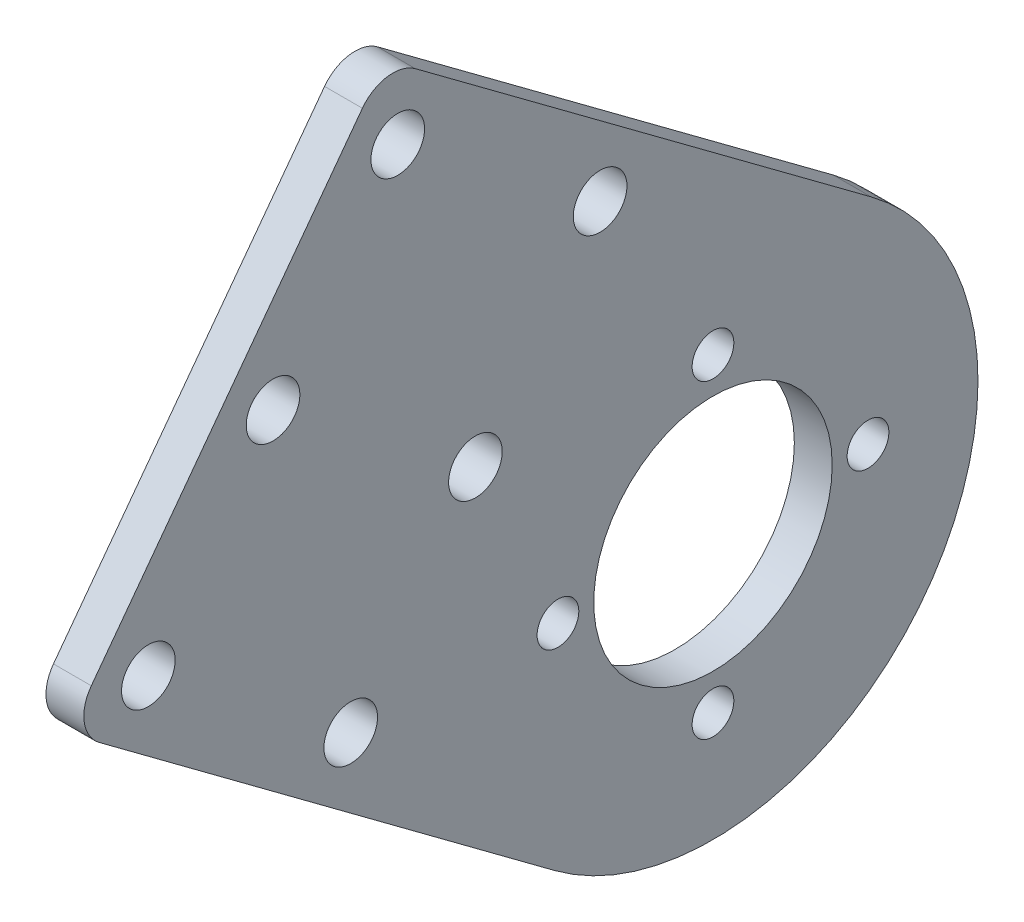
ISO-10303-21;
HEADER;
FILE_DESCRIPTION(('STEP AP214'),'2;1');
FILE_NAME('part.step','',(''),(''),'','','');
FILE_SCHEMA(('AUTOMOTIVE_DESIGN { 1 0 10303 214 1 1 1 1 }'));
ENDSEC;
DATA;
#1=APPLICATION_CONTEXT('core data for automotive mechanical design processes');
#2=APPLICATION_PROTOCOL_DEFINITION('international standard','automotive_design',2000,#1);
#3=PRODUCT_CONTEXT('',#1,'mechanical');
#4=PRODUCT('Part','Part','',(#3));
#5=PRODUCT_RELATED_PRODUCT_CATEGORY('part','',(#4));
#6=PRODUCT_DEFINITION_FORMATION('','',#4);
#7=PRODUCT_DEFINITION_CONTEXT('part definition',#1,'design');
#8=PRODUCT_DEFINITION('design','',#6,#7);
#9=PRODUCT_DEFINITION_SHAPE('','',#8);
#10=(LENGTH_UNIT() NAMED_UNIT(*) SI_UNIT(.MILLI.,.METRE.));
#11=(NAMED_UNIT(*) PLANE_ANGLE_UNIT() SI_UNIT($,.RADIAN.));
#12=(NAMED_UNIT(*) SI_UNIT($,.STERADIAN.) SOLID_ANGLE_UNIT());
#13=UNCERTAINTY_MEASURE_WITH_UNIT(LENGTH_MEASURE(1.E-05),#10,'distance_accuracy_value','');
#14=(GEOMETRIC_REPRESENTATION_CONTEXT(3) GLOBAL_UNCERTAINTY_ASSIGNED_CONTEXT((#13)) GLOBAL_UNIT_ASSIGNED_CONTEXT((#10,
#11,#12)) REPRESENTATION_CONTEXT('',''));
#15=CARTESIAN_POINT('',(0.,0.,0.));
#16=DIRECTION('',(0.,0.,1.));
#17=DIRECTION('',(1.,0.,0.));
#18=AXIS2_PLACEMENT_3D('',#15,#16,#17);
#19=CARTESIAN_POINT('',(3.175,87.5000000000012,-398.98926197498));
#20=DIRECTION('',(1.,0.,0.));
#21=DIRECTION('',(0.,0.,-1.));
#22=AXIS2_PLACEMENT_3D('',#19,#20,#21);
#23=PLANE('',#22);
#24=CARTESIAN_POINT('',(3.175,114.932192950069,-362.096397272571));
#25=DIRECTION('',(1.,0.,0.));
#26=DIRECTION('',(0.,0.,-1.));
#27=AXIS2_PLACEMENT_3D('',#24,#25,#26);
#28=CIRCLE('',#27,2.24999999999995);
#29=CARTESIAN_POINT('',(3.175,114.932192950069,-364.346397272571));
#30=VERTEX_POINT('',#29);
#31=EDGE_CURVE('E223',#30,#30,#28,.T.);
#32=ORIENTED_EDGE('',*,*,#31,.F.);
#33=EDGE_LOOP('',(#32));
#34=FACE_BOUND('',#33,.T.);
#35=CARTESIAN_POINT('',(3.175,128.996323692976,-372.553973590553));
#36=DIRECTION('',(1.,0.,0.));
#37=DIRECTION('',(0.,0.,-1.));
#38=AXIS2_PLACEMENT_3D('',#35,#36,#37);
#39=CIRCLE('',#38,2.24999999999996);
#40=CARTESIAN_POINT('',(3.175,128.996323692976,-374.803973590553));
#41=VERTEX_POINT('',#40);
#42=EDGE_CURVE('E235',#41,#41,#39,.T.);
#43=ORIENTED_EDGE('',*,*,#42,.F.);
#44=EDGE_LOOP('',(#43));
#45=FACE_BOUND('',#44,.T.);
#46=CARTESIAN_POINT('',(3.175,100.868062207161,-351.63882095459));
#47=DIRECTION('',(1.,0.,0.));
#48=DIRECTION('',(0.,0.,-1.));
#49=AXIS2_PLACEMENT_3D('',#46,#47,#48);
#50=CIRCLE('',#49,2.25000000000001);
#51=CARTESIAN_POINT('',(3.175,100.868062207161,-353.88882095459));
#52=VERTEX_POINT('',#51);
#53=EDGE_CURVE('E247',#52,#52,#50,.T.);
#54=ORIENTED_EDGE('',*,*,#53,.F.);
#55=EDGE_LOOP('',(#54));
#56=FACE_BOUND('',#55,.T.);
#57=CARTESIAN_POINT('',(3.175,87.5000000000012,-411.98926197498));
#58=DIRECTION('',(1.,0.,0.));
#59=DIRECTION('',(0.,0.,-1.));
#60=AXIS2_PLACEMENT_3D('',#57,#58,#59);
#61=CIRCLE('',#60,1.74999999999998);
#62=CARTESIAN_POINT('',(3.175,87.5000000000012,-413.73926197498));
#63=VERTEX_POINT('',#62);
#64=EDGE_CURVE('E259',#63,#63,#61,.T.);
#65=ORIENTED_EDGE('',*,*,#64,.F.);
#66=EDGE_LOOP('',(#65));
#67=FACE_BOUND('',#66,.T.);
#68=CARTESIAN_POINT('',(3.175,87.5000000000012,-385.98926197498));
#69=DIRECTION('',(1.,0.,0.));
#70=DIRECTION('',(0.,0.,-1.));
#71=AXIS2_PLACEMENT_3D('',#68,#69,#70);
#72=CIRCLE('',#71,1.74999999999998);
#73=CARTESIAN_POINT('',(3.175,87.5000000000012,-387.73926197498));
#74=VERTEX_POINT('',#73);
#75=EDGE_CURVE('E271',#74,#74,#72,.T.);
#76=ORIENTED_EDGE('',*,*,#75,.F.);
#77=EDGE_LOOP('',(#76));
#78=FACE_BOUND('',#77,.T.);
#79=CARTESIAN_POINT('',(3.175,87.5000000000012,-398.98926197498));
#80=DIRECTION('',(1.,0.,0.));
#81=DIRECTION('',(0.,0.,-1.));
#82=AXIS2_PLACEMENT_3D('',#79,#80,#81);
#83=CIRCLE('',#82,22.225);
#84=CARTESIAN_POINT('',(3.175,69.6650515941403,-385.727842731163));
#85=VERTEX_POINT('',#84);
#86=CARTESIAN_POINT('',(3.175,105.334948405862,-412.250681218797));
#87=VERTEX_POINT('',#86);
#88=EDGE_CURVE('E135',#85,#87,#83,.T.);
#89=ORIENTED_EDGE('',*,*,#88,.T.);
#90=DIRECTION('',(0.,0.596689279811797,0.802472369217582));
#91=VECTOR('',#90,1.);
#92=CARTESIAN_POINT('',(3.175,133.752275356899,-374.03293463481));
#93=LINE('',#92,#91);
#94=CARTESIAN_POINT('',(3.175,133.752275356899,-374.03293463481));
#95=VERTEX_POINT('',#94);
#96=EDGE_CURVE('E93',#87,#95,#93,.T.);
#97=ORIENTED_EDGE('',*,*,#96,.T.);
#98=CARTESIAN_POINT('',(3.175,131.204425584633,-372.138446171408));
#99=DIRECTION('',(1.,0.,0.));
#100=DIRECTION('',(0.,0.,1.));
#101=AXIS2_PLACEMENT_3D('',#98,#99,#100);
#102=CIRCLE('',#101,3.17500000000001);
#103=CARTESIAN_POINT('',(3.175,133.098914048035,-369.590596399142));
#104=VERTEX_POINT('',#103);
#105=EDGE_CURVE('E106',#95,#104,#102,.T.);
#106=ORIENTED_EDGE('',*,*,#105,.T.);
#107=DIRECTION('',(0.,-0.802472369217581,0.596689279811799));
#108=VECTOR('',#107,1.);
#109=CARTESIAN_POINT('',(3.175,102.524716780845,-346.856734838312));
#110=LINE('',#109,#108);
#111=CARTESIAN_POINT('',(3.175,102.524716780845,-346.856734838312));
#112=VERTEX_POINT('',#111);
#113=EDGE_CURVE('E100',#104,#112,#110,.T.);
#114=ORIENTED_EDGE('',*,*,#113,.T.);
#115=CARTESIAN_POINT('',(3.175,100.630228317443,-349.404584610578));
#116=DIRECTION('',(1.,0.,0.));
#117=DIRECTION('',(0.,0.,1.));
#118=AXIS2_PLACEMENT_3D('',#115,#116,#117);
#119=CIRCLE('',#118,3.17500000000002);
#120=CARTESIAN_POINT('',(3.175,98.0823785451771,-347.510096147176));
#121=VERTEX_POINT('',#120);
#122=EDGE_CURVE('E104',#112,#121,#119,.T.);
#123=ORIENTED_EDGE('',*,*,#122,.T.);
#124=DIRECTION('',(0.,-0.596689279811799,-0.802472369217581));
#125=VECTOR('',#124,1.);
#126=CARTESIAN_POINT('',(3.175,69.6650515941403,-385.727842731163));
#127=LINE('',#126,#125);
#128=EDGE_CURVE('E56',#121,#85,#127,.T.);
#129=ORIENTED_EDGE('',*,*,#128,.T.);
#130=EDGE_LOOP('',(#89,#97,#106,#114,#123,#129));
#131=FACE_BOUND('',#130,.T.);
#132=CARTESIAN_POINT('',(3.175,87.5000000000012,-398.98926197498));
#133=DIRECTION('',(1.,0.,0.));
#134=DIRECTION('',(0.,0.,-1.));
#135=AXIS2_PLACEMENT_3D('',#132,#133,#134);
#136=CIRCLE('',#135,9.99999999999998);
#137=CARTESIAN_POINT('',(3.175,87.5000000000012,-408.98926197498));
#138=VERTEX_POINT('',#137);
#139=EDGE_CURVE('E128',#138,#138,#136,.T.);
#140=ORIENTED_EDGE('',*,*,#139,.F.);
#141=EDGE_LOOP('',(#140));
#142=FACE_BOUND('',#141,.T.);
#143=CARTESIAN_POINT('',(3.175,100.500000000001,-398.98926197498));
#144=DIRECTION('',(1.,0.,0.));
#145=DIRECTION('',(0.,0.,-1.));
#146=AXIS2_PLACEMENT_3D('',#143,#144,#145);
#147=CIRCLE('',#146,1.74999999999998);
#148=CARTESIAN_POINT('',(3.175,100.500000000001,-400.73926197498));
#149=VERTEX_POINT('',#148);
#150=EDGE_CURVE('E265',#149,#149,#147,.T.);
#151=ORIENTED_EDGE('',*,*,#150,.F.);
#152=EDGE_LOOP('',(#151));
#153=FACE_BOUND('',#152,.T.);
#154=CARTESIAN_POINT('',(3.175,74.500000000001,-398.98926197498));
#155=DIRECTION('',(1.,0.,0.));
#156=DIRECTION('',(0.,0.,-1.));
#157=AXIS2_PLACEMENT_3D('',#154,#155,#156);
#158=CIRCLE('',#157,1.74999999999998);
#159=CARTESIAN_POINT('',(3.175,74.500000000001,-400.73926197498));
#160=VERTEX_POINT('',#159);
#161=EDGE_CURVE('E253',#160,#160,#158,.T.);
#162=ORIENTED_EDGE('',*,*,#161,.F.);
#163=EDGE_LOOP('',(#162));
#164=FACE_BOUND('',#163,.T.);
#165=CARTESIAN_POINT('',(3.175,88.2492773177012,-368.609506618803));
#166=DIRECTION('',(1.,0.,0.));
#167=DIRECTION('',(0.,0.,-1.));
#168=AXIS2_PLACEMENT_3D('',#165,#166,#167);
#169=CIRCLE('',#168,2.25000000000001);
#170=CARTESIAN_POINT('',(3.175,88.2492773177012,-370.859506618803));
#171=VERTEX_POINT('',#170);
#172=EDGE_CURVE('E241',#171,#171,#169,.T.);
#173=ORIENTED_EDGE('',*,*,#172,.F.);
#174=EDGE_LOOP('',(#173));
#175=FACE_BOUND('',#174,.T.);
#176=CARTESIAN_POINT('',(3.175,116.377538803516,-389.524659254767));
#177=DIRECTION('',(1.,0.,0.));
#178=DIRECTION('',(0.,0.,-1.));
#179=AXIS2_PLACEMENT_3D('',#176,#177,#178);
#180=CIRCLE('',#179,2.24999999999995);
#181=CARTESIAN_POINT('',(3.175,116.377538803516,-391.774659254767));
#182=VERTEX_POINT('',#181);
#183=EDGE_CURVE('E229',#182,#182,#180,.T.);
#184=ORIENTED_EDGE('',*,*,#183,.F.);
#185=EDGE_LOOP('',(#184));
#186=FACE_BOUND('',#185,.T.);
#187=CARTESIAN_POINT('',(3.175,102.313408060608,-379.067082936785));
#188=DIRECTION('',(1.,0.,0.));
#189=DIRECTION('',(0.,0.,-1.));
#190=AXIS2_PLACEMENT_3D('',#187,#188,#189);
#191=CIRCLE('',#190,2.24999999999995);
#192=CARTESIAN_POINT('',(3.175,102.313408060608,-381.317082936785));
#193=VERTEX_POINT('',#192);
#194=EDGE_CURVE('E214',#193,#193,#191,.T.);
#195=ORIENTED_EDGE('',*,*,#194,.F.);
#196=EDGE_LOOP('',(#195));
#197=FACE_BOUND('',#196,.T.);
#198=ADVANCED_FACE('F39',(#34,#45,#56,#67,#78,#131,#142,#153,#164,#175,#186,#197),#23,.T.);
#199=CARTESIAN_POINT('',(0.,87.5000000000012,-398.98926197498));
#200=DIRECTION('',(1.,0.,0.));
#201=DIRECTION('',(0.,0.,-1.));
#202=AXIS2_PLACEMENT_3D('',#199,#200,#201);
#203=PLANE('',#202);
#204=CARTESIAN_POINT('',(0.,87.5000000000012,-398.98926197498));
#205=DIRECTION('',(1.,0.,0.));
#206=DIRECTION('',(0.,0.,-1.));
#207=AXIS2_PLACEMENT_3D('',#204,#205,#206);
#208=CIRCLE('',#207,22.225);
#209=CARTESIAN_POINT('',(0.,69.6650515941403,-385.727842731163));
#210=VERTEX_POINT('',#209);
#211=CARTESIAN_POINT('',(0.,105.334948405862,-412.250681218797));
#212=VERTEX_POINT('',#211);
#213=EDGE_CURVE('E124',#210,#212,#208,.T.);
#214=ORIENTED_EDGE('',*,*,#213,.F.);
#215=DIRECTION('',(0.,-0.596689279811799,-0.802472369217581));
#216=VECTOR('',#215,1.);
#217=CARTESIAN_POINT('',(0.,69.6650515941403,-385.727842731163));
#218=LINE('',#217,#216);
#219=CARTESIAN_POINT('',(0.,98.0823785451771,-347.510096147176));
#220=VERTEX_POINT('',#219);
#221=EDGE_CURVE('E85',#220,#210,#218,.T.);
#222=ORIENTED_EDGE('',*,*,#221,.F.);
#223=CARTESIAN_POINT('',(0.,100.630228317443,-349.404584610578));
#224=DIRECTION('',(1.,0.,0.));
#225=DIRECTION('',(0.,0.,1.));
#226=AXIS2_PLACEMENT_3D('',#223,#224,#225);
#227=CIRCLE('',#226,3.17500000000002);
#228=CARTESIAN_POINT('',(0.,102.524716780845,-346.856734838312));
#229=VERTEX_POINT('',#228);
#230=EDGE_CURVE('E79',#229,#220,#227,.T.);
#231=ORIENTED_EDGE('',*,*,#230,.F.);
#232=DIRECTION('',(0.,-0.802472369217581,0.596689279811799));
#233=VECTOR('',#232,1.);
#234=CARTESIAN_POINT('',(0.,102.524716780845,-346.856734838312));
#235=LINE('',#234,#233);
#236=CARTESIAN_POINT('',(0.,133.098914048035,-369.590596399142));
#237=VERTEX_POINT('',#236);
#238=EDGE_CURVE('E114',#237,#229,#235,.T.);
#239=ORIENTED_EDGE('',*,*,#238,.F.);
#240=CARTESIAN_POINT('',(0.,131.204425584633,-372.138446171408));
#241=DIRECTION('',(1.,0.,0.));
#242=DIRECTION('',(0.,0.,1.));
#243=AXIS2_PLACEMENT_3D('',#240,#241,#242);
#244=CIRCLE('',#243,3.17500000000001);
#245=CARTESIAN_POINT('',(0.,133.752275356899,-374.03293463481));
#246=VERTEX_POINT('',#245);
#247=EDGE_CURVE('E130',#246,#237,#244,.T.);
#248=ORIENTED_EDGE('',*,*,#247,.F.);
#249=DIRECTION('',(0.,0.596689279811797,0.802472369217582));
#250=VECTOR('',#249,1.);
#251=CARTESIAN_POINT('',(0.,133.752275356899,-374.03293463481));
#252=LINE('',#251,#250);
#253=EDGE_CURVE('E127',#212,#246,#252,.T.);
#254=ORIENTED_EDGE('',*,*,#253,.F.);
#255=EDGE_LOOP('',(#214,#222,#231,#239,#248,#254));
#256=FACE_BOUND('',#255,.T.);
#257=CARTESIAN_POINT('',(0.,87.5000000000012,-398.98926197498));
#258=DIRECTION('',(1.,0.,0.));
#259=DIRECTION('',(0.,0.,-1.));
#260=AXIS2_PLACEMENT_3D('',#257,#258,#259);
#261=CIRCLE('',#260,9.99999999999998);
#262=CARTESIAN_POINT('',(0.,87.5000000000012,-408.98926197498));
#263=VERTEX_POINT('',#262);
#264=EDGE_CURVE('E274',#263,#263,#261,.T.);
#265=ORIENTED_EDGE('',*,*,#264,.T.);
#266=EDGE_LOOP('',(#265));
#267=FACE_BOUND('',#266,.T.);
#268=CARTESIAN_POINT('',(0.,87.5000000000012,-385.98926197498));
#269=DIRECTION('',(1.,0.,0.));
#270=DIRECTION('',(0.,0.,-1.));
#271=AXIS2_PLACEMENT_3D('',#268,#269,#270);
#272=CIRCLE('',#271,1.74999999999998);
#273=CARTESIAN_POINT('',(0.,87.5000000000012,-387.73926197498));
#274=VERTEX_POINT('',#273);
#275=EDGE_CURVE('E268',#274,#274,#272,.T.);
#276=ORIENTED_EDGE('',*,*,#275,.T.);
#277=EDGE_LOOP('',(#276));
#278=FACE_BOUND('',#277,.T.);
#279=CARTESIAN_POINT('',(0.,100.500000000001,-398.98926197498));
#280=DIRECTION('',(1.,0.,0.));
#281=DIRECTION('',(0.,0.,-1.));
#282=AXIS2_PLACEMENT_3D('',#279,#280,#281);
#283=CIRCLE('',#282,1.74999999999998);
#284=CARTESIAN_POINT('',(0.,100.500000000001,-400.73926197498));
#285=VERTEX_POINT('',#284);
#286=EDGE_CURVE('E262',#285,#285,#283,.T.);
#287=ORIENTED_EDGE('',*,*,#286,.T.);
#288=EDGE_LOOP('',(#287));
#289=FACE_BOUND('',#288,.T.);
#290=CARTESIAN_POINT('',(0.,87.5000000000012,-411.98926197498));
#291=DIRECTION('',(1.,0.,0.));
#292=DIRECTION('',(0.,0.,-1.));
#293=AXIS2_PLACEMENT_3D('',#290,#291,#292);
#294=CIRCLE('',#293,1.74999999999998);
#295=CARTESIAN_POINT('',(0.,87.5000000000012,-413.73926197498));
#296=VERTEX_POINT('',#295);
#297=EDGE_CURVE('E256',#296,#296,#294,.T.);
#298=ORIENTED_EDGE('',*,*,#297,.T.);
#299=EDGE_LOOP('',(#298));
#300=FACE_BOUND('',#299,.T.);
#301=CARTESIAN_POINT('',(0.,74.500000000001,-398.98926197498));
#302=DIRECTION('',(1.,0.,0.));
#303=DIRECTION('',(0.,0.,-1.));
#304=AXIS2_PLACEMENT_3D('',#301,#302,#303);
#305=CIRCLE('',#304,1.74999999999998);
#306=CARTESIAN_POINT('',(0.,74.500000000001,-400.73926197498));
#307=VERTEX_POINT('',#306);
#308=EDGE_CURVE('E250',#307,#307,#305,.T.);
#309=ORIENTED_EDGE('',*,*,#308,.T.);
#310=EDGE_LOOP('',(#309));
#311=FACE_BOUND('',#310,.T.);
#312=CARTESIAN_POINT('',(0.,100.868062207161,-351.63882095459));
#313=DIRECTION('',(1.,0.,0.));
#314=DIRECTION('',(0.,0.,-1.));
#315=AXIS2_PLACEMENT_3D('',#312,#313,#314);
#316=CIRCLE('',#315,2.25000000000001);
#317=CARTESIAN_POINT('',(0.,100.868062207161,-353.88882095459));
#318=VERTEX_POINT('',#317);
#319=EDGE_CURVE('E244',#318,#318,#316,.T.);
#320=ORIENTED_EDGE('',*,*,#319,.T.);
#321=EDGE_LOOP('',(#320));
#322=FACE_BOUND('',#321,.T.);
#323=CARTESIAN_POINT('',(0.,88.2492773177012,-368.609506618803));
#324=DIRECTION('',(1.,0.,0.));
#325=DIRECTION('',(0.,0.,-1.));
#326=AXIS2_PLACEMENT_3D('',#323,#324,#325);
#327=CIRCLE('',#326,2.25000000000001);
#328=CARTESIAN_POINT('',(0.,88.2492773177012,-370.859506618803));
#329=VERTEX_POINT('',#328);
#330=EDGE_CURVE('E238',#329,#329,#327,.T.);
#331=ORIENTED_EDGE('',*,*,#330,.T.);
#332=EDGE_LOOP('',(#331));
#333=FACE_BOUND('',#332,.T.);
#334=CARTESIAN_POINT('',(0.,128.996323692976,-372.553973590553));
#335=DIRECTION('',(1.,0.,0.));
#336=DIRECTION('',(0.,0.,-1.));
#337=AXIS2_PLACEMENT_3D('',#334,#335,#336);
#338=CIRCLE('',#337,2.24999999999996);
#339=CARTESIAN_POINT('',(0.,128.996323692976,-374.803973590553));
#340=VERTEX_POINT('',#339);
#341=EDGE_CURVE('E232',#340,#340,#338,.T.);
#342=ORIENTED_EDGE('',*,*,#341,.T.);
#343=EDGE_LOOP('',(#342));
#344=FACE_BOUND('',#343,.T.);
#345=CARTESIAN_POINT('',(0.,116.377538803516,-389.524659254767));
#346=DIRECTION('',(1.,0.,0.));
#347=DIRECTION('',(0.,0.,-1.));
#348=AXIS2_PLACEMENT_3D('',#345,#346,#347);
#349=CIRCLE('',#348,2.24999999999995);
#350=CARTESIAN_POINT('',(0.,116.377538803516,-391.774659254767));
#351=VERTEX_POINT('',#350);
#352=EDGE_CURVE('E226',#351,#351,#349,.T.);
#353=ORIENTED_EDGE('',*,*,#352,.T.);
#354=EDGE_LOOP('',(#353));
#355=FACE_BOUND('',#354,.T.);
#356=CARTESIAN_POINT('',(0.,114.932192950069,-362.096397272571));
#357=DIRECTION('',(1.,0.,0.));
#358=DIRECTION('',(0.,0.,-1.));
#359=AXIS2_PLACEMENT_3D('',#356,#357,#358);
#360=CIRCLE('',#359,2.24999999999995);
#361=CARTESIAN_POINT('',(0.,114.932192950069,-364.346397272571));
#362=VERTEX_POINT('',#361);
#363=EDGE_CURVE('E220',#362,#362,#360,.T.);
#364=ORIENTED_EDGE('',*,*,#363,.T.);
#365=EDGE_LOOP('',(#364));
#366=FACE_BOUND('',#365,.T.);
#367=CARTESIAN_POINT('',(0.,102.313408060608,-379.067082936785));
#368=DIRECTION('',(1.,0.,0.));
#369=DIRECTION('',(0.,0.,-1.));
#370=AXIS2_PLACEMENT_3D('',#367,#368,#369);
#371=CIRCLE('',#370,2.24999999999995);
#372=CARTESIAN_POINT('',(0.,102.313408060608,-381.317082936785));
#373=VERTEX_POINT('',#372);
#374=EDGE_CURVE('E217',#373,#373,#371,.T.);
#375=ORIENTED_EDGE('',*,*,#374,.T.);
#376=EDGE_LOOP('',(#375));
#377=FACE_BOUND('',#376,.T.);
#378=ADVANCED_FACE('F144',(#256,#267,#278,#289,#300,#311,#322,#333,#344,#355,#366,#377),#203,.F.);
#379=CARTESIAN_POINT('',(3.175,87.5000000000012,-398.98926197498));
#380=DIRECTION('',(-1.,0.,0.));
#381=DIRECTION('',(0.,0.,1.));
#382=AXIS2_PLACEMENT_3D('',#379,#380,#381);
#383=CYLINDRICAL_SURFACE('',#382,22.225);
#384=ORIENTED_EDGE('',*,*,#213,.T.);
#385=DIRECTION('',(-1.,0.,0.));
#386=VECTOR('',#385,1.);
#387=CARTESIAN_POINT('',(3.175,105.334948405862,-412.250681218797));
#388=LINE('',#387,#386);
#389=EDGE_CURVE('E11',#87,#212,#388,.T.);
#390=ORIENTED_EDGE('',*,*,#389,.F.);
#391=ORIENTED_EDGE('',*,*,#88,.F.);
#392=DIRECTION('',(-1.,0.,0.));
#393=VECTOR('',#392,1.);
#394=CARTESIAN_POINT('',(3.175,69.6650515941403,-385.727842731163));
#395=LINE('',#394,#393);
#396=EDGE_CURVE('E120',#85,#210,#395,.T.);
#397=ORIENTED_EDGE('',*,*,#396,.T.);
#398=EDGE_LOOP('',(#384,#390,#391,#397));
#399=FACE_BOUND('',#398,.T.);
#400=ADVANCED_FACE('F41',(#399),#383,.T.);
#401=CARTESIAN_POINT('',(3.175,133.752275356899,-374.03293463481));
#402=DIRECTION('',(0.,-0.802472369217582,0.596689279811797));
#403=DIRECTION('',(0.,-0.596689279811797,-0.802472369217582));
#404=AXIS2_PLACEMENT_3D('',#401,#402,#403);
#405=PLANE('',#404);
#406=ORIENTED_EDGE('',*,*,#253,.T.);
#407=DIRECTION('',(-1.,0.,0.));
#408=VECTOR('',#407,1.);
#409=CARTESIAN_POINT('',(3.175,133.752275356899,-374.03293463481));
#410=LINE('',#409,#408);
#411=EDGE_CURVE('E48',#95,#246,#410,.T.);
#412=ORIENTED_EDGE('',*,*,#411,.F.);
#413=ORIENTED_EDGE('',*,*,#96,.F.);
#414=ORIENTED_EDGE('',*,*,#389,.T.);
#415=EDGE_LOOP('',(#406,#412,#413,#414));
#416=FACE_BOUND('',#415,.T.);
#417=ADVANCED_FACE('F406',(#416),#405,.F.);
#418=CARTESIAN_POINT('',(3.175,131.204425584633,-372.138446171408));
#419=DIRECTION('',(-1.,0.,0.));
#420=DIRECTION('',(0.,0.,1.));
#421=AXIS2_PLACEMENT_3D('',#418,#419,#420);
#422=CYLINDRICAL_SURFACE('',#421,3.17500000000001);
#423=ORIENTED_EDGE('',*,*,#247,.T.);
#424=DIRECTION('',(-1.,0.,0.));
#425=VECTOR('',#424,1.);
#426=CARTESIAN_POINT('',(3.175,133.098914048035,-369.590596399142));
#427=LINE('',#426,#425);
#428=EDGE_CURVE('E115',#104,#237,#427,.T.);
#429=ORIENTED_EDGE('',*,*,#428,.F.);
#430=ORIENTED_EDGE('',*,*,#105,.F.);
#431=ORIENTED_EDGE('',*,*,#411,.T.);
#432=EDGE_LOOP('',(#423,#429,#430,#431));
#433=FACE_BOUND('',#432,.T.);
#434=ADVANCED_FACE('F141',(#433),#422,.T.);
#435=CARTESIAN_POINT('',(3.175,102.524716780845,-346.856734838312));
#436=DIRECTION('',(0.,-0.596689279811799,-0.802472369217581));
#437=DIRECTION('',(0.,0.802472369217581,-0.596689279811799));
#438=AXIS2_PLACEMENT_3D('',#435,#436,#437);
#439=PLANE('',#438);
#440=ORIENTED_EDGE('',*,*,#238,.T.);
#441=DIRECTION('',(-1.,0.,0.));
#442=VECTOR('',#441,1.);
#443=CARTESIAN_POINT('',(3.175,102.524716780845,-346.856734838312));
#444=LINE('',#443,#442);
#445=EDGE_CURVE('E111',#112,#229,#444,.T.);
#446=ORIENTED_EDGE('',*,*,#445,.F.);
#447=ORIENTED_EDGE('',*,*,#113,.F.);
#448=ORIENTED_EDGE('',*,*,#428,.T.);
#449=EDGE_LOOP('',(#440,#446,#447,#448));
#450=FACE_BOUND('',#449,.T.);
#451=ADVANCED_FACE('F112',(#450),#439,.F.);
#452=CARTESIAN_POINT('',(3.175,100.630228317443,-349.404584610578));
#453=DIRECTION('',(-1.,0.,0.));
#454=DIRECTION('',(0.,0.,1.));
#455=AXIS2_PLACEMENT_3D('',#452,#453,#454);
#456=CYLINDRICAL_SURFACE('',#455,3.17500000000002);
#457=ORIENTED_EDGE('',*,*,#230,.T.);
#458=DIRECTION('',(-1.,0.,0.));
#459=VECTOR('',#458,1.);
#460=CARTESIAN_POINT('',(3.175,98.0823785451771,-347.510096147176));
#461=LINE('',#460,#459);
#462=EDGE_CURVE('E116',#121,#220,#461,.T.);
#463=ORIENTED_EDGE('',*,*,#462,.F.);
#464=ORIENTED_EDGE('',*,*,#122,.F.);
#465=ORIENTED_EDGE('',*,*,#445,.T.);
#466=EDGE_LOOP('',(#457,#463,#464,#465));
#467=FACE_BOUND('',#466,.T.);
#468=ADVANCED_FACE('F118',(#467),#456,.T.);
#469=CARTESIAN_POINT('',(3.175,69.6650515941403,-385.727842731163));
#470=DIRECTION('',(0.,0.802472369217581,-0.596689279811799));
#471=DIRECTION('',(0.,0.596689279811799,0.802472369217581));
#472=AXIS2_PLACEMENT_3D('',#469,#470,#471);
#473=PLANE('',#472);
#474=ORIENTED_EDGE('',*,*,#221,.T.);
#475=ORIENTED_EDGE('',*,*,#396,.F.);
#476=ORIENTED_EDGE('',*,*,#128,.F.);
#477=ORIENTED_EDGE('',*,*,#462,.T.);
#478=EDGE_LOOP('',(#474,#475,#476,#477));
#479=FACE_BOUND('',#478,.T.);
#480=ADVANCED_FACE('F149',(#479),#473,.F.);
#481=CARTESIAN_POINT('',(3.175,87.5000000000012,-398.98926197498));
#482=DIRECTION('',(-1.,0.,0.));
#483=DIRECTION('',(0.,0.,1.));
#484=AXIS2_PLACEMENT_3D('',#481,#482,#483);
#485=CYLINDRICAL_SURFACE('',#484,9.99999999999998);
#486=ORIENTED_EDGE('',*,*,#139,.T.);
#487=EDGE_LOOP('',(#486));
#488=FACE_BOUND('',#487,.T.);
#489=ORIENTED_EDGE('',*,*,#264,.F.);
#490=EDGE_LOOP('',(#489));
#491=FACE_BOUND('',#490,.T.);
#492=ADVANCED_FACE('F151',(#488,#491),#485,.F.);
#493=CARTESIAN_POINT('',(3.175,87.5000000000012,-385.98926197498));
#494=DIRECTION('',(-1.,0.,0.));
#495=DIRECTION('',(0.,0.,1.));
#496=AXIS2_PLACEMENT_3D('',#493,#494,#495);
#497=CYLINDRICAL_SURFACE('',#496,1.74999999999998);
#498=ORIENTED_EDGE('',*,*,#75,.T.);
#499=EDGE_LOOP('',(#498));
#500=FACE_BOUND('',#499,.T.);
#501=ORIENTED_EDGE('',*,*,#275,.F.);
#502=EDGE_LOOP('',(#501));
#503=FACE_BOUND('',#502,.T.);
#504=ADVANCED_FACE('F157',(#500,#503),#497,.F.);
#505=CARTESIAN_POINT('',(3.175,100.500000000001,-398.98926197498));
#506=DIRECTION('',(-1.,0.,0.));
#507=DIRECTION('',(0.,0.,1.));
#508=AXIS2_PLACEMENT_3D('',#505,#506,#507);
#509=CYLINDRICAL_SURFACE('',#508,1.74999999999998);
#510=ORIENTED_EDGE('',*,*,#150,.T.);
#511=EDGE_LOOP('',(#510));
#512=FACE_BOUND('',#511,.T.);
#513=ORIENTED_EDGE('',*,*,#286,.F.);
#514=EDGE_LOOP('',(#513));
#515=FACE_BOUND('',#514,.T.);
#516=ADVANCED_FACE('F173',(#512,#515),#509,.F.);
#517=CARTESIAN_POINT('',(3.175,87.5000000000012,-411.98926197498));
#518=DIRECTION('',(-1.,0.,0.));
#519=DIRECTION('',(0.,0.,1.));
#520=AXIS2_PLACEMENT_3D('',#517,#518,#519);
#521=CYLINDRICAL_SURFACE('',#520,1.74999999999998);
#522=ORIENTED_EDGE('',*,*,#64,.T.);
#523=EDGE_LOOP('',(#522));
#524=FACE_BOUND('',#523,.T.);
#525=ORIENTED_EDGE('',*,*,#297,.F.);
#526=EDGE_LOOP('',(#525));
#527=FACE_BOUND('',#526,.T.);
#528=ADVANCED_FACE('F177',(#524,#527),#521,.F.);
#529=CARTESIAN_POINT('',(3.175,74.500000000001,-398.98926197498));
#530=DIRECTION('',(-1.,0.,0.));
#531=DIRECTION('',(0.,0.,1.));
#532=AXIS2_PLACEMENT_3D('',#529,#530,#531);
#533=CYLINDRICAL_SURFACE('',#532,1.74999999999998);
#534=ORIENTED_EDGE('',*,*,#161,.T.);
#535=EDGE_LOOP('',(#534));
#536=FACE_BOUND('',#535,.T.);
#537=ORIENTED_EDGE('',*,*,#308,.F.);
#538=EDGE_LOOP('',(#537));
#539=FACE_BOUND('',#538,.T.);
#540=ADVANCED_FACE('F181',(#536,#539),#533,.F.);
#541=CARTESIAN_POINT('',(3.175,100.868062207161,-351.63882095459));
#542=DIRECTION('',(-1.,0.,0.));
#543=DIRECTION('',(0.,0.,1.));
#544=AXIS2_PLACEMENT_3D('',#541,#542,#543);
#545=CYLINDRICAL_SURFACE('',#544,2.25000000000001);
#546=ORIENTED_EDGE('',*,*,#53,.T.);
#547=EDGE_LOOP('',(#546));
#548=FACE_BOUND('',#547,.T.);
#549=ORIENTED_EDGE('',*,*,#319,.F.);
#550=EDGE_LOOP('',(#549));
#551=FACE_BOUND('',#550,.T.);
#552=ADVANCED_FACE('F185',(#548,#551),#545,.F.);
#553=CARTESIAN_POINT('',(3.175,88.2492773177012,-368.609506618803));
#554=DIRECTION('',(-1.,0.,0.));
#555=DIRECTION('',(0.,0.,1.));
#556=AXIS2_PLACEMENT_3D('',#553,#554,#555);
#557=CYLINDRICAL_SURFACE('',#556,2.25000000000001);
#558=ORIENTED_EDGE('',*,*,#172,.T.);
#559=EDGE_LOOP('',(#558));
#560=FACE_BOUND('',#559,.T.);
#561=ORIENTED_EDGE('',*,*,#330,.F.);
#562=EDGE_LOOP('',(#561));
#563=FACE_BOUND('',#562,.T.);
#564=ADVANCED_FACE('F189',(#560,#563),#557,.F.);
#565=CARTESIAN_POINT('',(3.175,128.996323692976,-372.553973590553));
#566=DIRECTION('',(-1.,0.,0.));
#567=DIRECTION('',(0.,0.,1.));
#568=AXIS2_PLACEMENT_3D('',#565,#566,#567);
#569=CYLINDRICAL_SURFACE('',#568,2.24999999999996);
#570=ORIENTED_EDGE('',*,*,#42,.T.);
#571=EDGE_LOOP('',(#570));
#572=FACE_BOUND('',#571,.T.);
#573=ORIENTED_EDGE('',*,*,#341,.F.);
#574=EDGE_LOOP('',(#573));
#575=FACE_BOUND('',#574,.T.);
#576=ADVANCED_FACE('F193',(#572,#575),#569,.F.);
#577=CARTESIAN_POINT('',(3.175,116.377538803516,-389.524659254767));
#578=DIRECTION('',(-1.,0.,0.));
#579=DIRECTION('',(0.,0.,1.));
#580=AXIS2_PLACEMENT_3D('',#577,#578,#579);
#581=CYLINDRICAL_SURFACE('',#580,2.24999999999995);
#582=ORIENTED_EDGE('',*,*,#183,.T.);
#583=EDGE_LOOP('',(#582));
#584=FACE_BOUND('',#583,.T.);
#585=ORIENTED_EDGE('',*,*,#352,.F.);
#586=EDGE_LOOP('',(#585));
#587=FACE_BOUND('',#586,.T.);
#588=ADVANCED_FACE('F197',(#584,#587),#581,.F.);
#589=CARTESIAN_POINT('',(3.175,114.932192950069,-362.096397272571));
#590=DIRECTION('',(-1.,0.,0.));
#591=DIRECTION('',(0.,0.,1.));
#592=AXIS2_PLACEMENT_3D('',#589,#590,#591);
#593=CYLINDRICAL_SURFACE('',#592,2.24999999999995);
#594=ORIENTED_EDGE('',*,*,#31,.T.);
#595=EDGE_LOOP('',(#594));
#596=FACE_BOUND('',#595,.T.);
#597=ORIENTED_EDGE('',*,*,#363,.F.);
#598=EDGE_LOOP('',(#597));
#599=FACE_BOUND('',#598,.T.);
#600=ADVANCED_FACE('F201',(#596,#599),#593,.F.);
#601=CARTESIAN_POINT('',(3.175,102.313408060608,-379.067082936785));
#602=DIRECTION('',(-1.,0.,0.));
#603=DIRECTION('',(0.,0.,1.));
#604=AXIS2_PLACEMENT_3D('',#601,#602,#603);
#605=CYLINDRICAL_SURFACE('',#604,2.24999999999995);
#606=ORIENTED_EDGE('',*,*,#194,.T.);
#607=EDGE_LOOP('',(#606));
#608=FACE_BOUND('',#607,.T.);
#609=ORIENTED_EDGE('',*,*,#374,.F.);
#610=EDGE_LOOP('',(#609));
#611=FACE_BOUND('',#610,.T.);
#612=ADVANCED_FACE('F205',(#608,#611),#605,.F.);
#613=CLOSED_SHELL('',(#198,#378,#400,#417,#434,#451,#468,#480,#492,#504,#516,#528,#540,#552,
#564,#576,#588,#600,#612));
#614=MANIFOLD_SOLID_BREP('B2',#613);
#615=ADVANCED_BREP_SHAPE_REPRESENTATION('',(#18,#614),#14);
#616=SHAPE_DEFINITION_REPRESENTATION(#9,#615);
ENDSEC;
END-ISO-10303-21;
